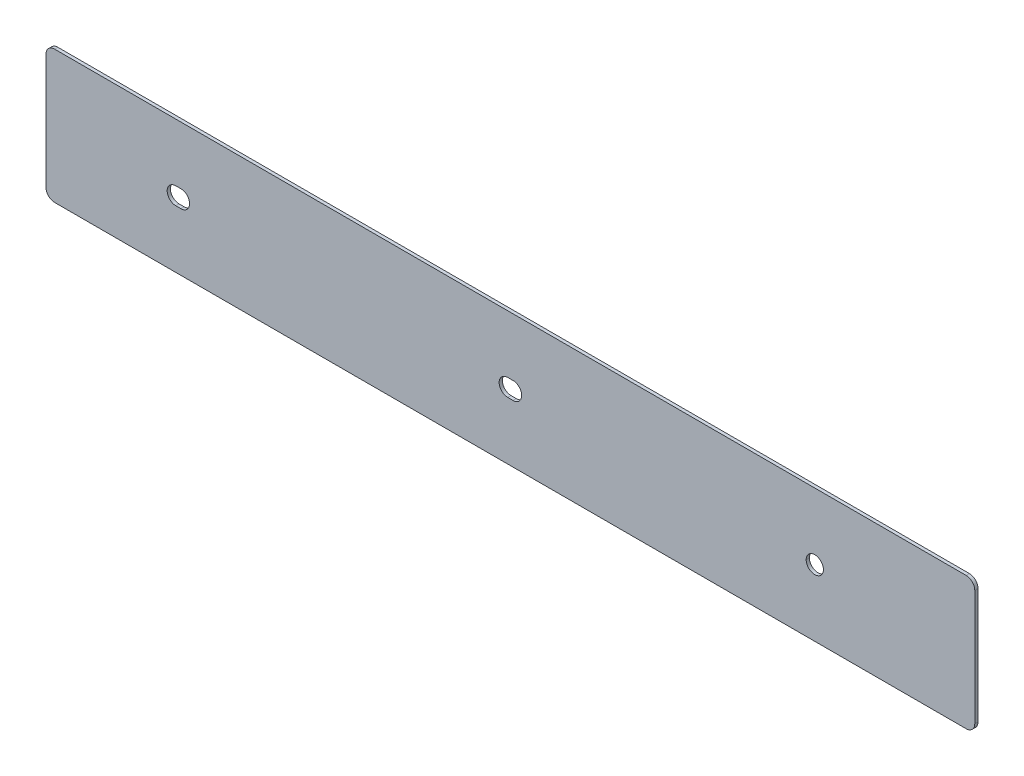
ISO-10303-21;
HEADER;
FILE_DESCRIPTION(('STEP AP214'),'2;1');
FILE_NAME('part.step','',(''),(''),'','','');
FILE_SCHEMA(('AUTOMOTIVE_DESIGN { 1 0 10303 214 1 1 1 1 }'));
ENDSEC;
DATA;
#1=APPLICATION_CONTEXT('core data for automotive mechanical design processes');
#2=APPLICATION_PROTOCOL_DEFINITION('international standard','automotive_design',2000,#1);
#3=PRODUCT_CONTEXT('',#1,'mechanical');
#4=PRODUCT('Part','Part','',(#3));
#5=PRODUCT_RELATED_PRODUCT_CATEGORY('part','',(#4));
#6=PRODUCT_DEFINITION_FORMATION('','',#4);
#7=PRODUCT_DEFINITION_CONTEXT('part definition',#1,'design');
#8=PRODUCT_DEFINITION('design','',#6,#7);
#9=PRODUCT_DEFINITION_SHAPE('','',#8);
#10=(LENGTH_UNIT() NAMED_UNIT(*) SI_UNIT(.MILLI.,.METRE.));
#11=(NAMED_UNIT(*) PLANE_ANGLE_UNIT() SI_UNIT($,.RADIAN.));
#12=(NAMED_UNIT(*) SI_UNIT($,.STERADIAN.) SOLID_ANGLE_UNIT());
#13=UNCERTAINTY_MEASURE_WITH_UNIT(LENGTH_MEASURE(1.E-05),#10,'distance_accuracy_value','');
#14=(GEOMETRIC_REPRESENTATION_CONTEXT(3) GLOBAL_UNCERTAINTY_ASSIGNED_CONTEXT((#13)) GLOBAL_UNIT_ASSIGNED_CONTEXT((#10,
#11,#12)) REPRESENTATION_CONTEXT('',''));
#15=CARTESIAN_POINT('',(0.,0.,0.));
#16=DIRECTION('',(0.,0.,1.));
#17=DIRECTION('',(1.,0.,0.));
#18=AXIS2_PLACEMENT_3D('',#15,#16,#17);
#19=CARTESIAN_POINT('',(-0.3,0.,-11.92));
#20=DIRECTION('',(0.,0.,1.));
#21=DIRECTION('',(1.,0.,0.));
#22=AXIS2_PLACEMENT_3D('',#19,#20,#21);
#23=CYLINDRICAL_SURFACE('',#22,1.);
#24=DIRECTION('',(0.,0.,1.));
#25=VECTOR('',#24,1.);
#26=CARTESIAN_POINT('',(-0.2999999999993,-1.,-12.295));
#27=LINE('',#26,#25);
#28=CARTESIAN_POINT('',(-0.2999999999993,-1.,-12.295));
#29=VERTEX_POINT('',#28);
#30=CARTESIAN_POINT('',(-0.2999999999978,-1.,-11.92));
#31=VERTEX_POINT('',#30);
#32=EDGE_CURVE('E11',#29,#31,#27,.T.);
#33=ORIENTED_EDGE('',*,*,#32,.F.);
#34=CARTESIAN_POINT('',(-0.3,0.,-12.295));
#35=DIRECTION('',(0.,0.,-1.));
#36=DIRECTION('',(2.190136960678E-12,-1.,0.));
#37=AXIS2_PLACEMENT_3D('',#34,#35,#36);
#38=CIRCLE('',#37,1.);
#39=CARTESIAN_POINT('',(-1.3,0.,-12.295));
#40=VERTEX_POINT('',#39);
#41=EDGE_CURVE('E337',#29,#40,#38,.T.);
#42=ORIENTED_EDGE('',*,*,#41,.T.);
#43=CARTESIAN_POINT('',(-0.3,0.,-12.295));
#44=DIRECTION('',(0.,0.,-1.));
#45=DIRECTION('',(-1.,0.,0.));
#46=AXIS2_PLACEMENT_3D('',#43,#44,#45);
#47=CIRCLE('',#46,1.);
#48=CARTESIAN_POINT('',(-0.3,1.,-12.295));
#49=VERTEX_POINT('',#48);
#50=EDGE_CURVE('E342',#40,#49,#47,.T.);
#51=ORIENTED_EDGE('',*,*,#50,.T.);
#52=DIRECTION('',(0.,0.,-1.));
#53=VECTOR('',#52,1.);
#54=CARTESIAN_POINT('',(-0.3,1.,-11.92));
#55=LINE('',#54,#53);
#56=CARTESIAN_POINT('',(-0.3,1.,-11.92));
#57=VERTEX_POINT('',#56);
#58=EDGE_CURVE('E372',#57,#49,#55,.T.);
#59=ORIENTED_EDGE('',*,*,#58,.F.);
#60=CARTESIAN_POINT('',(-0.3,0.,-11.92));
#61=DIRECTION('',(0.,0.,1.));
#62=DIRECTION('',(0.,1.,0.));
#63=AXIS2_PLACEMENT_3D('',#60,#61,#62);
#64=CIRCLE('',#63,1.);
#65=CARTESIAN_POINT('',(-1.3,0.,-11.92));
#66=VERTEX_POINT('',#65);
#67=EDGE_CURVE('E245',#57,#66,#64,.T.);
#68=ORIENTED_EDGE('',*,*,#67,.T.);
#69=CARTESIAN_POINT('',(-0.3,0.,-11.92));
#70=DIRECTION('',(0.,0.,1.));
#71=DIRECTION('',(-1.,0.,0.));
#72=AXIS2_PLACEMENT_3D('',#69,#70,#71);
#73=CIRCLE('',#72,1.);
#74=EDGE_CURVE('E243',#66,#31,#73,.T.);
#75=ORIENTED_EDGE('',*,*,#74,.T.);
#76=EDGE_LOOP('',(#33,#42,#51,#59,#68,#75));
#77=FACE_BOUND('',#76,.T.);
#78=ADVANCED_FACE('F17',(#77),#23,.F.);
#79=CARTESIAN_POINT('',(0.3,-1.007966227043,-11.92));
#80=DIRECTION('',(0.0132758749875694,0.999911871688358,0.));
#81=DIRECTION('',(0.,0.,-1.));
#82=AXIS2_PLACEMENT_3D('',#79,#80,#81);
#83=PLANE('',#82);
#84=DIRECTION('',(0.,0.,-1.));
#85=VECTOR('',#84,1.);
#86=CARTESIAN_POINT('',(0.3,-1.007966227043,-11.92));
#87=LINE('',#86,#85);
#88=CARTESIAN_POINT('',(0.3,-1.007966227043,-11.92));
#89=VERTEX_POINT('',#88);
#90=CARTESIAN_POINT('',(0.3,-1.007966227043,-12.295));
#91=VERTEX_POINT('',#90);
#92=EDGE_CURVE('E28',#89,#91,#87,.T.);
#93=ORIENTED_EDGE('',*,*,#92,.T.);
#94=DIRECTION('',(0.999911871688355,-0.0132758749877494,0.));
#95=VECTOR('',#94,1.);
#96=CARTESIAN_POINT('',(-0.2999999999993,-1.,-12.295));
#97=LINE('',#96,#95);
#98=EDGE_CURVE('E341',#29,#91,#97,.T.);
#99=ORIENTED_EDGE('',*,*,#98,.F.);
#100=ORIENTED_EDGE('',*,*,#32,.T.);
#101=DIRECTION('',(0.999911871688355,-0.0132758749877494,0.));
#102=VECTOR('',#101,1.);
#103=CARTESIAN_POINT('',(-0.2999999999993,-1.,-11.92));
#104=LINE('',#103,#102);
#105=EDGE_CURVE('E246',#31,#89,#104,.T.);
#106=ORIENTED_EDGE('',*,*,#105,.T.);
#107=EDGE_LOOP('',(#93,#99,#100,#106));
#108=FACE_BOUND('',#107,.T.);
#109=ADVANCED_FACE('F533',(#108),#83,.T.);
#110=CARTESIAN_POINT('',(0.3,0.,-11.92));
#111=DIRECTION('',(0.,0.,1.));
#112=DIRECTION('',(1.,0.,0.));
#113=AXIS2_PLACEMENT_3D('',#110,#111,#112);
#114=CYLINDRICAL_SURFACE('',#113,1.007966227043);
#115=DIRECTION('',(0.,0.,1.));
#116=VECTOR('',#115,1.);
#117=CARTESIAN_POINT('',(0.4264749574373,1.,-12.295));
#118=LINE('',#117,#116);
#119=CARTESIAN_POINT('',(0.4264749574373,1.,-12.295));
#120=VERTEX_POINT('',#119);
#121=CARTESIAN_POINT('',(0.4264749574373,1.,-11.92));
#122=VERTEX_POINT('',#121);
#123=EDGE_CURVE('E42',#120,#122,#118,.T.);
#124=ORIENTED_EDGE('',*,*,#123,.F.);
#125=CARTESIAN_POINT('',(0.3,0.,-12.295));
#126=DIRECTION('',(0.,0.,-1.));
#127=DIRECTION('',(0.125475391977297,0.992096732182978,0.));
#128=AXIS2_PLACEMENT_3D('',#125,#126,#127);
#129=CIRCLE('',#128,1.007966227043);
#130=CARTESIAN_POINT('',(1.307966227043,0.,-12.295));
#131=VERTEX_POINT('',#130);
#132=EDGE_CURVE('E309',#120,#131,#129,.T.);
#133=ORIENTED_EDGE('',*,*,#132,.T.);
#134=CARTESIAN_POINT('',(0.3,0.,-12.295));
#135=DIRECTION('',(0.,0.,-1.));
#136=DIRECTION('',(1.,0.,0.));
#137=AXIS2_PLACEMENT_3D('',#134,#135,#136);
#138=CIRCLE('',#137,1.007966227043);
#139=EDGE_CURVE('E367',#131,#91,#138,.T.);
#140=ORIENTED_EDGE('',*,*,#139,.T.);
#141=ORIENTED_EDGE('',*,*,#92,.F.);
#142=CARTESIAN_POINT('',(0.3,0.,-11.92));
#143=DIRECTION('',(0.,0.,1.));
#144=DIRECTION('',(0.,-1.,0.));
#145=AXIS2_PLACEMENT_3D('',#142,#143,#144);
#146=CIRCLE('',#145,1.007966227043);
#147=CARTESIAN_POINT('',(1.307966227043,0.,-11.92));
#148=VERTEX_POINT('',#147);
#149=EDGE_CURVE('E314',#89,#148,#146,.T.);
#150=ORIENTED_EDGE('',*,*,#149,.T.);
#151=CARTESIAN_POINT('',(0.3,0.,-11.92));
#152=DIRECTION('',(0.,0.,1.));
#153=DIRECTION('',(1.,0.,0.));
#154=AXIS2_PLACEMENT_3D('',#151,#152,#153);
#155=CIRCLE('',#154,1.007966227043);
#156=EDGE_CURVE('E316',#148,#122,#155,.T.);
#157=ORIENTED_EDGE('',*,*,#156,.T.);
#158=EDGE_LOOP('',(#124,#133,#140,#141,#150,#157));
#159=FACE_BOUND('',#158,.T.);
#160=ADVANCED_FACE('F528',(#159),#114,.F.);
#161=CARTESIAN_POINT('',(-0.3,1.,-11.92));
#162=DIRECTION('',(0.,-1.,0.));
#163=DIRECTION('',(0.,0.,-1.));
#164=AXIS2_PLACEMENT_3D('',#161,#162,#163);
#165=PLANE('',#164);
#166=ORIENTED_EDGE('',*,*,#58,.T.);
#167=DIRECTION('',(-1.,-1.433482581109E-13,0.));
#168=VECTOR('',#167,1.);
#169=CARTESIAN_POINT('',(0.4264749574373,1.,-12.295));
#170=LINE('',#169,#168);
#171=EDGE_CURVE('E299',#120,#49,#170,.T.);
#172=ORIENTED_EDGE('',*,*,#171,.F.);
#173=ORIENTED_EDGE('',*,*,#123,.T.);
#174=DIRECTION('',(-1.,-1.433482581109E-13,0.));
#175=VECTOR('',#174,1.);
#176=CARTESIAN_POINT('',(0.4264749574373,1.,-11.92));
#177=LINE('',#176,#175);
#178=EDGE_CURVE('E329',#122,#57,#177,.T.);
#179=ORIENTED_EDGE('',*,*,#178,.T.);
#180=EDGE_LOOP('',(#166,#172,#173,#179));
#181=FACE_BOUND('',#180,.T.);
#182=ADVANCED_FACE('F532',(#181),#165,.T.);
#183=CARTESIAN_POINT('',(-38.8,0.,-11.92));
#184=DIRECTION('',(0.,0.,1.));
#185=DIRECTION('',(1.,0.,0.));
#186=AXIS2_PLACEMENT_3D('',#183,#184,#185);
#187=CYLINDRICAL_SURFACE('',#186,1.);
#188=DIRECTION('',(0.,0.,1.));
#189=VECTOR('',#188,1.);
#190=CARTESIAN_POINT('',(-38.8,-1.,-12.295));
#191=LINE('',#190,#189);
#192=CARTESIAN_POINT('',(-38.8,-1.,-12.295));
#193=VERTEX_POINT('',#192);
#194=CARTESIAN_POINT('',(-38.8,-1.,-11.92));
#195=VERTEX_POINT('',#194);
#196=EDGE_CURVE('E369',#193,#195,#191,.T.);
#197=ORIENTED_EDGE('',*,*,#196,.F.);
#198=CARTESIAN_POINT('',(-38.8,0.,-12.295));
#199=DIRECTION('',(0.,0.,-1.));
#200=DIRECTION('',(0.,-1.,0.));
#201=AXIS2_PLACEMENT_3D('',#198,#199,#200);
#202=CIRCLE('',#201,1.);
#203=CARTESIAN_POINT('',(-39.8,0.,-12.295));
#204=VERTEX_POINT('',#203);
#205=EDGE_CURVE('E181',#193,#204,#202,.T.);
#206=ORIENTED_EDGE('',*,*,#205,.T.);
#207=CARTESIAN_POINT('',(-38.8,0.,-12.295));
#208=DIRECTION('',(0.,0.,-1.));
#209=DIRECTION('',(-1.,0.,0.));
#210=AXIS2_PLACEMENT_3D('',#207,#208,#209);
#211=CIRCLE('',#210,1.);
#212=CARTESIAN_POINT('',(-38.8,1.,-12.295));
#213=VERTEX_POINT('',#212);
#214=EDGE_CURVE('E277',#204,#213,#211,.T.);
#215=ORIENTED_EDGE('',*,*,#214,.T.);
#216=DIRECTION('',(0.,0.,-1.));
#217=VECTOR('',#216,1.);
#218=CARTESIAN_POINT('',(-38.8,1.,-11.92));
#219=LINE('',#218,#217);
#220=CARTESIAN_POINT('',(-38.8,1.,-11.92));
#221=VERTEX_POINT('',#220);
#222=EDGE_CURVE('E192',#221,#213,#219,.T.);
#223=ORIENTED_EDGE('',*,*,#222,.F.);
#224=CARTESIAN_POINT('',(-38.8,0.,-11.92));
#225=DIRECTION('',(0.,0.,1.));
#226=DIRECTION('',(0.,1.,0.));
#227=AXIS2_PLACEMENT_3D('',#224,#225,#226);
#228=CIRCLE('',#227,1.);
#229=CARTESIAN_POINT('',(-39.8,0.,-11.92));
#230=VERTEX_POINT('',#229);
#231=EDGE_CURVE('E215',#221,#230,#228,.T.);
#232=ORIENTED_EDGE('',*,*,#231,.T.);
#233=CARTESIAN_POINT('',(-38.8,0.,-11.92));
#234=DIRECTION('',(0.,0.,1.));
#235=DIRECTION('',(-1.,0.,0.));
#236=AXIS2_PLACEMENT_3D('',#233,#234,#235);
#237=CIRCLE('',#236,1.);
#238=EDGE_CURVE('E218',#230,#195,#237,.T.);
#239=ORIENTED_EDGE('',*,*,#238,.T.);
#240=EDGE_LOOP('',(#197,#206,#215,#223,#232,#239));
#241=FACE_BOUND('',#240,.T.);
#242=ADVANCED_FACE('F217',(#241),#187,.F.);
#243=CARTESIAN_POINT('',(-38.2,-1.,-11.92));
#244=DIRECTION('',(0.,1.,0.));
#245=DIRECTION('',(1.,0.,0.));
#246=AXIS2_PLACEMENT_3D('',#243,#244,#245);
#247=PLANE('',#246);
#248=DIRECTION('',(0.,0.,-1.));
#249=VECTOR('',#248,1.);
#250=CARTESIAN_POINT('',(-38.2,-1.,-11.92));
#251=LINE('',#250,#249);
#252=CARTESIAN_POINT('',(-38.2,-1.,-11.92));
#253=VERTEX_POINT('',#252);
#254=CARTESIAN_POINT('',(-38.2,-1.,-12.295));
#255=VERTEX_POINT('',#254);
#256=EDGE_CURVE('E373',#253,#255,#251,.T.);
#257=ORIENTED_EDGE('',*,*,#256,.T.);
#258=DIRECTION('',(1.,0.,0.));
#259=VECTOR('',#258,1.);
#260=CARTESIAN_POINT('',(-38.8,-1.,-12.295));
#261=LINE('',#260,#259);
#262=EDGE_CURVE('E354',#193,#255,#261,.T.);
#263=ORIENTED_EDGE('',*,*,#262,.F.);
#264=ORIENTED_EDGE('',*,*,#196,.T.);
#265=DIRECTION('',(1.,0.,0.));
#266=VECTOR('',#265,1.);
#267=CARTESIAN_POINT('',(-38.8,-1.,-11.92));
#268=LINE('',#267,#266);
#269=EDGE_CURVE('E230',#195,#253,#268,.T.);
#270=ORIENTED_EDGE('',*,*,#269,.T.);
#271=EDGE_LOOP('',(#257,#263,#264,#270));
#272=FACE_BOUND('',#271,.T.);
#273=ADVANCED_FACE('F541',(#272),#247,.T.);
#274=CARTESIAN_POINT('',(-38.2,0.,-11.92));
#275=DIRECTION('',(0.,0.,1.));
#276=DIRECTION('',(1.,0.,0.));
#277=AXIS2_PLACEMENT_3D('',#274,#275,#276);
#278=CYLINDRICAL_SURFACE('',#277,1.);
#279=DIRECTION('',(0.,0.,1.));
#280=VECTOR('',#279,1.);
#281=CARTESIAN_POINT('',(-38.2,1.,-12.295));
#282=LINE('',#281,#280);
#283=CARTESIAN_POINT('',(-38.2,1.,-12.295));
#284=VERTEX_POINT('',#283);
#285=CARTESIAN_POINT('',(-38.2,1.,-11.92));
#286=VERTEX_POINT('',#285);
#287=EDGE_CURVE('E296',#284,#286,#282,.T.);
#288=ORIENTED_EDGE('',*,*,#287,.F.);
#289=CARTESIAN_POINT('',(-38.2,0.,-12.295));
#290=DIRECTION('',(0.,0.,-1.));
#291=DIRECTION('',(0.,1.,0.));
#292=AXIS2_PLACEMENT_3D('',#289,#290,#291);
#293=CIRCLE('',#292,1.);
#294=CARTESIAN_POINT('',(-37.2,0.,-12.295));
#295=VERTEX_POINT('',#294);
#296=EDGE_CURVE('E279',#284,#295,#293,.T.);
#297=ORIENTED_EDGE('',*,*,#296,.T.);
#298=CARTESIAN_POINT('',(-38.2,0.,-12.295));
#299=DIRECTION('',(0.,0.,-1.));
#300=DIRECTION('',(1.,0.,0.));
#301=AXIS2_PLACEMENT_3D('',#298,#299,#300);
#302=CIRCLE('',#301,1.);
#303=EDGE_CURVE('E283',#295,#255,#302,.T.);
#304=ORIENTED_EDGE('',*,*,#303,.T.);
#305=ORIENTED_EDGE('',*,*,#256,.F.);
#306=CARTESIAN_POINT('',(-38.2,0.,-11.92));
#307=DIRECTION('',(0.,0.,1.));
#308=DIRECTION('',(0.,-1.,0.));
#309=AXIS2_PLACEMENT_3D('',#306,#307,#308);
#310=CIRCLE('',#309,1.);
#311=CARTESIAN_POINT('',(-37.2,0.,-11.92));
#312=VERTEX_POINT('',#311);
#313=EDGE_CURVE('E237',#253,#312,#310,.T.);
#314=ORIENTED_EDGE('',*,*,#313,.T.);
#315=CARTESIAN_POINT('',(-38.2,0.,-11.92));
#316=DIRECTION('',(0.,0.,1.));
#317=DIRECTION('',(1.,0.,0.));
#318=AXIS2_PLACEMENT_3D('',#315,#316,#317);
#319=CIRCLE('',#318,1.);
#320=EDGE_CURVE('E355',#312,#286,#319,.T.);
#321=ORIENTED_EDGE('',*,*,#320,.T.);
#322=EDGE_LOOP('',(#288,#297,#304,#305,#314,#321));
#323=FACE_BOUND('',#322,.T.);
#324=ADVANCED_FACE('F516',(#323),#278,.F.);
#325=CARTESIAN_POINT('',(-38.8,1.,-11.92));
#326=DIRECTION('',(0.,-1.,0.));
#327=DIRECTION('',(0.,0.,-1.));
#328=AXIS2_PLACEMENT_3D('',#325,#326,#327);
#329=PLANE('',#328);
#330=ORIENTED_EDGE('',*,*,#222,.T.);
#331=DIRECTION('',(-1.,0.,0.));
#332=VECTOR('',#331,1.);
#333=CARTESIAN_POINT('',(-38.2,1.,-12.295));
#334=LINE('',#333,#332);
#335=EDGE_CURVE('E282',#284,#213,#334,.T.);
#336=ORIENTED_EDGE('',*,*,#335,.F.);
#337=ORIENTED_EDGE('',*,*,#287,.T.);
#338=DIRECTION('',(-1.,0.,0.));
#339=VECTOR('',#338,1.);
#340=CARTESIAN_POINT('',(-38.2,1.,-11.92));
#341=LINE('',#340,#339);
#342=EDGE_CURVE('E223',#286,#221,#341,.T.);
#343=ORIENTED_EDGE('',*,*,#342,.T.);
#344=EDGE_LOOP('',(#330,#336,#337,#343));
#345=FACE_BOUND('',#344,.T.);
#346=ADVANCED_FACE('F512',(#345),#329,.T.);
#347=CARTESIAN_POINT('',(35.3,0.,-11.92));
#348=DIRECTION('',(0.,0.,1.));
#349=DIRECTION('',(1.,0.,0.));
#350=AXIS2_PLACEMENT_3D('',#347,#348,#349);
#351=CYLINDRICAL_SURFACE('',#350,1.);
#352=DIRECTION('',(0.,0.,1.));
#353=VECTOR('',#352,1.);
#354=CARTESIAN_POINT('',(34.3,0.,-12.295));
#355=LINE('',#354,#353);
#356=CARTESIAN_POINT('',(34.3,0.,-12.295));
#357=VERTEX_POINT('',#356);
#358=CARTESIAN_POINT('',(34.3,0.,-11.92));
#359=VERTEX_POINT('',#358);
#360=EDGE_CURVE('E288',#357,#359,#355,.T.);
#361=ORIENTED_EDGE('',*,*,#360,.F.);
#362=CARTESIAN_POINT('',(35.3,0.,-12.295));
#363=DIRECTION('',(0.,0.,-1.));
#364=DIRECTION('',(-1.,0.,0.));
#365=AXIS2_PLACEMENT_3D('',#362,#363,#364);
#366=CIRCLE('',#365,1.);
#367=CARTESIAN_POINT('',(36.3,0.,-12.295));
#368=VERTEX_POINT('',#367);
#369=EDGE_CURVE('E287',#357,#368,#366,.T.);
#370=ORIENTED_EDGE('',*,*,#369,.T.);
#371=DIRECTION('',(0.,0.,1.));
#372=VECTOR('',#371,1.);
#373=CARTESIAN_POINT('',(36.3,0.,-12.295));
#374=LINE('',#373,#372);
#375=CARTESIAN_POINT('',(36.3,0.,-11.92));
#376=VERTEX_POINT('',#375);
#377=EDGE_CURVE('E290',#368,#376,#374,.T.);
#378=ORIENTED_EDGE('',*,*,#377,.T.);
#379=CARTESIAN_POINT('',(35.3,0.,-11.92));
#380=DIRECTION('',(0.,0.,1.));
#381=DIRECTION('',(1.,0.,0.));
#382=AXIS2_PLACEMENT_3D('',#379,#380,#381);
#383=CIRCLE('',#382,1.);
#384=EDGE_CURVE('E407',#376,#359,#383,.T.);
#385=ORIENTED_EDGE('',*,*,#384,.T.);
#386=EDGE_LOOP('',(#361,#370,#378,#385));
#387=FACE_BOUND('',#386,.T.);
#388=ADVANCED_FACE('F452',(#387),#351,.F.);
#389=CARTESIAN_POINT('',(35.3,0.,-11.92));
#390=DIRECTION('',(0.,0.,1.));
#391=DIRECTION('',(1.,0.,0.));
#392=AXIS2_PLACEMENT_3D('',#389,#390,#391);
#393=CYLINDRICAL_SURFACE('',#392,1.);
#394=ORIENTED_EDGE('',*,*,#377,.F.);
#395=CARTESIAN_POINT('',(35.3,0.,-12.295));
#396=DIRECTION('',(0.,0.,-1.));
#397=DIRECTION('',(1.,0.,0.));
#398=AXIS2_PLACEMENT_3D('',#395,#396,#397);
#399=CIRCLE('',#398,1.);
#400=EDGE_CURVE('E284',#368,#357,#399,.T.);
#401=ORIENTED_EDGE('',*,*,#400,.T.);
#402=ORIENTED_EDGE('',*,*,#360,.T.);
#403=CARTESIAN_POINT('',(35.3,0.,-11.92));
#404=DIRECTION('',(0.,0.,1.));
#405=DIRECTION('',(-1.,0.,0.));
#406=AXIS2_PLACEMENT_3D('',#403,#404,#405);
#407=CIRCLE('',#406,1.);
#408=EDGE_CURVE('E359',#359,#376,#407,.T.);
#409=ORIENTED_EDGE('',*,*,#408,.T.);
#410=EDGE_LOOP('',(#394,#401,#402,#409));
#411=FACE_BOUND('',#410,.T.);
#412=ADVANCED_FACE('F456',(#411),#393,.F.);
#413=CARTESIAN_POINT('',(0.,0.,-12.295));
#414=DIRECTION('',(0.,0.,1.));
#415=DIRECTION('',(1.,0.,0.));
#416=AXIS2_PLACEMENT_3D('',#413,#414,#415);
#417=PLANE('',#416);
#418=ORIENTED_EDGE('',*,*,#50,.F.);
#419=ORIENTED_EDGE('',*,*,#41,.F.);
#420=ORIENTED_EDGE('',*,*,#98,.T.);
#421=ORIENTED_EDGE('',*,*,#139,.F.);
#422=ORIENTED_EDGE('',*,*,#132,.F.);
#423=ORIENTED_EDGE('',*,*,#171,.T.);
#424=EDGE_LOOP('',(#418,#419,#420,#421,#422,#423));
#425=FACE_BOUND('',#424,.T.);
#426=ORIENTED_EDGE('',*,*,#214,.F.);
#427=ORIENTED_EDGE('',*,*,#205,.F.);
#428=ORIENTED_EDGE('',*,*,#262,.T.);
#429=ORIENTED_EDGE('',*,*,#303,.F.);
#430=ORIENTED_EDGE('',*,*,#296,.F.);
#431=ORIENTED_EDGE('',*,*,#335,.T.);
#432=EDGE_LOOP('',(#426,#427,#428,#429,#430,#431));
#433=FACE_BOUND('',#432,.T.);
#434=ORIENTED_EDGE('',*,*,#369,.F.);
#435=ORIENTED_EDGE('',*,*,#400,.F.);
#436=EDGE_LOOP('',(#434,#435));
#437=FACE_BOUND('',#436,.T.);
#438=DIRECTION('',(0.,-1.,0.));
#439=VECTOR('',#438,1.);
#440=CARTESIAN_POINT('',(53.85,6.7,-12.295));
#441=LINE('',#440,#439);
#442=CARTESIAN_POINT('',(53.85,6.7,-12.295));
#443=VERTEX_POINT('',#442);
#444=CARTESIAN_POINT('',(53.85,-6.7,-12.295));
#445=VERTEX_POINT('',#444);
#446=EDGE_CURVE('E343',#443,#445,#441,.T.);
#447=ORIENTED_EDGE('',*,*,#446,.T.);
#448=CARTESIAN_POINT('',(52.85,-6.7,-12.295));
#449=DIRECTION('',(0.,0.,1.));
#450=DIRECTION('',(0.,-1.,0.));
#451=AXIS2_PLACEMENT_3D('',#448,#449,#450);
#452=CIRCLE('',#451,1.);
#453=CARTESIAN_POINT('',(52.85,-7.7,-12.295));
#454=VERTEX_POINT('',#453);
#455=EDGE_CURVE('E241',#454,#445,#452,.T.);
#456=ORIENTED_EDGE('',*,*,#455,.F.);
#457=DIRECTION('',(-1.,0.,0.));
#458=VECTOR('',#457,1.);
#459=CARTESIAN_POINT('',(52.85,-7.7,-12.295));
#460=LINE('',#459,#458);
#461=CARTESIAN_POINT('',(-52.85,-7.7,-12.295));
#462=VERTEX_POINT('',#461);
#463=EDGE_CURVE('E319',#454,#462,#460,.T.);
#464=ORIENTED_EDGE('',*,*,#463,.T.);
#465=CARTESIAN_POINT('',(-52.85,-6.7,-12.295));
#466=DIRECTION('',(0.,0.,1.));
#467=DIRECTION('',(-1.,0.,0.));
#468=AXIS2_PLACEMENT_3D('',#465,#466,#467);
#469=CIRCLE('',#468,1.);
#470=CARTESIAN_POINT('',(-53.85,-6.7,-12.295));
#471=VERTEX_POINT('',#470);
#472=EDGE_CURVE('E350',#471,#462,#469,.T.);
#473=ORIENTED_EDGE('',*,*,#472,.F.);
#474=DIRECTION('',(0.,1.,0.));
#475=VECTOR('',#474,1.);
#476=CARTESIAN_POINT('',(-53.85,-6.7,-12.295));
#477=LINE('',#476,#475);
#478=CARTESIAN_POINT('',(-53.85,6.7,-12.295));
#479=VERTEX_POINT('',#478);
#480=EDGE_CURVE('E382',#471,#479,#477,.T.);
#481=ORIENTED_EDGE('',*,*,#480,.T.);
#482=CARTESIAN_POINT('',(-52.85,6.7,-12.295));
#483=DIRECTION('',(0.,0.,1.));
#484=DIRECTION('',(0.,1.,0.));
#485=AXIS2_PLACEMENT_3D('',#482,#483,#484);
#486=CIRCLE('',#485,1.);
#487=CARTESIAN_POINT('',(-52.85,7.7,-12.295));
#488=VERTEX_POINT('',#487);
#489=EDGE_CURVE('E249',#488,#479,#486,.T.);
#490=ORIENTED_EDGE('',*,*,#489,.F.);
#491=DIRECTION('',(1.,0.,0.));
#492=VECTOR('',#491,1.);
#493=CARTESIAN_POINT('',(-52.85,7.7,-12.295));
#494=LINE('',#493,#492);
#495=CARTESIAN_POINT('',(52.85,7.7,-12.295));
#496=VERTEX_POINT('',#495);
#497=EDGE_CURVE('E250',#488,#496,#494,.T.);
#498=ORIENTED_EDGE('',*,*,#497,.T.);
#499=CARTESIAN_POINT('',(52.85,6.7,-12.295));
#500=DIRECTION('',(0.,0.,1.));
#501=DIRECTION('',(1.,0.,0.));
#502=AXIS2_PLACEMENT_3D('',#499,#500,#501);
#503=CIRCLE('',#502,1.);
#504=EDGE_CURVE('E273',#443,#496,#503,.T.);
#505=ORIENTED_EDGE('',*,*,#504,.F.);
#506=EDGE_LOOP('',(#447,#456,#464,#473,#481,#490,#498,#505));
#507=FACE_BOUND('',#506,.T.);
#508=ADVANCED_FACE('F455',(#425,#433,#437,#507),#417,.F.);
#509=CARTESIAN_POINT('',(53.85,-6.7,-11.92));
#510=DIRECTION('',(1.,0.,0.));
#511=DIRECTION('',(0.,1.,0.));
#512=AXIS2_PLACEMENT_3D('',#509,#510,#511);
#513=PLANE('',#512);
#514=DIRECTION('',(0.,0.,-1.));
#515=VECTOR('',#514,1.);
#516=CARTESIAN_POINT('',(53.85,-6.7,-11.92));
#517=LINE('',#516,#515);
#518=CARTESIAN_POINT('',(53.85,-6.7,-11.92));
#519=VERTEX_POINT('',#518);
#520=EDGE_CURVE('E346',#519,#445,#517,.T.);
#521=ORIENTED_EDGE('',*,*,#520,.T.);
#522=ORIENTED_EDGE('',*,*,#446,.F.);
#523=DIRECTION('',(0.,0.,1.));
#524=VECTOR('',#523,1.);
#525=CARTESIAN_POINT('',(53.85,6.7,-12.295));
#526=LINE('',#525,#524);
#527=CARTESIAN_POINT('',(53.85,6.7,-11.92));
#528=VERTEX_POINT('',#527);
#529=EDGE_CURVE('E327',#443,#528,#526,.T.);
#530=ORIENTED_EDGE('',*,*,#529,.T.);
#531=DIRECTION('',(0.,-1.,0.));
#532=VECTOR('',#531,1.);
#533=CARTESIAN_POINT('',(53.85,6.7,-11.92));
#534=LINE('',#533,#532);
#535=EDGE_CURVE('E21',#528,#519,#534,.T.);
#536=ORIENTED_EDGE('',*,*,#535,.T.);
#537=EDGE_LOOP('',(#521,#522,#530,#536));
#538=FACE_BOUND('',#537,.T.);
#539=ADVANCED_FACE('F475',(#538),#513,.T.);
#540=CARTESIAN_POINT('',(52.85,-6.7,-11.92));
#541=DIRECTION('',(0.,0.,1.));
#542=DIRECTION('',(1.,0.,0.));
#543=AXIS2_PLACEMENT_3D('',#540,#541,#542);
#544=CYLINDRICAL_SURFACE('',#543,1.);
#545=DIRECTION('',(0.,0.,1.));
#546=VECTOR('',#545,1.);
#547=CARTESIAN_POINT('',(52.85,-7.7,-12.295));
#548=LINE('',#547,#546);
#549=CARTESIAN_POINT('',(52.85,-7.7,-11.92));
#550=VERTEX_POINT('',#549);
#551=EDGE_CURVE('E322',#454,#550,#548,.T.);
#552=ORIENTED_EDGE('',*,*,#551,.F.);
#553=ORIENTED_EDGE('',*,*,#455,.T.);
#554=ORIENTED_EDGE('',*,*,#520,.F.);
#555=CARTESIAN_POINT('',(52.85,-6.7,-11.92));
#556=DIRECTION('',(0.,0.,-1.));
#557=DIRECTION('',(1.,0.,0.));
#558=AXIS2_PLACEMENT_3D('',#555,#556,#557);
#559=CIRCLE('',#558,1.);
#560=EDGE_CURVE('E377',#519,#550,#559,.T.);
#561=ORIENTED_EDGE('',*,*,#560,.T.);
#562=EDGE_LOOP('',(#552,#553,#554,#561));
#563=FACE_BOUND('',#562,.T.);
#564=ADVANCED_FACE('F478',(#563),#544,.T.);
#565=CARTESIAN_POINT('',(-52.85,-7.7,-11.92));
#566=DIRECTION('',(0.,-1.,0.));
#567=DIRECTION('',(0.,0.,-1.));
#568=AXIS2_PLACEMENT_3D('',#565,#566,#567);
#569=PLANE('',#568);
#570=DIRECTION('',(0.,0.,-1.));
#571=VECTOR('',#570,1.);
#572=CARTESIAN_POINT('',(-52.85,-7.7,-11.92));
#573=LINE('',#572,#571);
#574=CARTESIAN_POINT('',(-52.85,-7.7,-11.92));
#575=VERTEX_POINT('',#574);
#576=EDGE_CURVE('E323',#575,#462,#573,.T.);
#577=ORIENTED_EDGE('',*,*,#576,.T.);
#578=ORIENTED_EDGE('',*,*,#463,.F.);
#579=ORIENTED_EDGE('',*,*,#551,.T.);
#580=DIRECTION('',(-1.,0.,0.));
#581=VECTOR('',#580,1.);
#582=CARTESIAN_POINT('',(52.85,-7.7,-11.92));
#583=LINE('',#582,#581);
#584=EDGE_CURVE('E335',#550,#575,#583,.T.);
#585=ORIENTED_EDGE('',*,*,#584,.T.);
#586=EDGE_LOOP('',(#577,#578,#579,#585));
#587=FACE_BOUND('',#586,.T.);
#588=ADVANCED_FACE('F485',(#587),#569,.T.);
#589=CARTESIAN_POINT('',(-52.85,-6.7,-11.92));
#590=DIRECTION('',(0.,0.,1.));
#591=DIRECTION('',(1.,0.,0.));
#592=AXIS2_PLACEMENT_3D('',#589,#590,#591);
#593=CYLINDRICAL_SURFACE('',#592,1.);
#594=DIRECTION('',(0.,0.,1.));
#595=VECTOR('',#594,1.);
#596=CARTESIAN_POINT('',(-53.85,-6.7,-12.295));
#597=LINE('',#596,#595);
#598=CARTESIAN_POINT('',(-53.85,-6.7,-11.92));
#599=VERTEX_POINT('',#598);
#600=EDGE_CURVE('E380',#471,#599,#597,.T.);
#601=ORIENTED_EDGE('',*,*,#600,.F.);
#602=ORIENTED_EDGE('',*,*,#472,.T.);
#603=ORIENTED_EDGE('',*,*,#576,.F.);
#604=CARTESIAN_POINT('',(-52.85,-6.7,-11.92));
#605=DIRECTION('',(0.,0.,-1.));
#606=DIRECTION('',(0.,-1.,0.));
#607=AXIS2_PLACEMENT_3D('',#604,#605,#606);
#608=CIRCLE('',#607,1.);
#609=EDGE_CURVE('E331',#575,#599,#608,.T.);
#610=ORIENTED_EDGE('',*,*,#609,.T.);
#611=EDGE_LOOP('',(#601,#602,#603,#610));
#612=FACE_BOUND('',#611,.T.);
#613=ADVANCED_FACE('F490',(#612),#593,.T.);
#614=CARTESIAN_POINT('',(-53.85,6.7,-11.92));
#615=DIRECTION('',(-1.,0.,0.));
#616=DIRECTION('',(0.,0.,1.));
#617=AXIS2_PLACEMENT_3D('',#614,#615,#616);
#618=PLANE('',#617);
#619=DIRECTION('',(0.,0.,-1.));
#620=VECTOR('',#619,1.);
#621=CARTESIAN_POINT('',(-53.85,6.7,-11.92));
#622=LINE('',#621,#620);
#623=CARTESIAN_POINT('',(-53.85,6.7,-11.92));
#624=VERTEX_POINT('',#623);
#625=EDGE_CURVE('E260',#624,#479,#622,.T.);
#626=ORIENTED_EDGE('',*,*,#625,.T.);
#627=ORIENTED_EDGE('',*,*,#480,.F.);
#628=ORIENTED_EDGE('',*,*,#600,.T.);
#629=DIRECTION('',(0.,1.,0.));
#630=VECTOR('',#629,1.);
#631=CARTESIAN_POINT('',(-53.85,-6.7,-11.92));
#632=LINE('',#631,#630);
#633=EDGE_CURVE('E336',#599,#624,#632,.T.);
#634=ORIENTED_EDGE('',*,*,#633,.T.);
#635=EDGE_LOOP('',(#626,#627,#628,#634));
#636=FACE_BOUND('',#635,.T.);
#637=ADVANCED_FACE('F19',(#636),#618,.T.);
#638=CARTESIAN_POINT('',(-52.85,6.7,-11.92));
#639=DIRECTION('',(0.,0.,1.));
#640=DIRECTION('',(1.,0.,0.));
#641=AXIS2_PLACEMENT_3D('',#638,#639,#640);
#642=CYLINDRICAL_SURFACE('',#641,1.);
#643=DIRECTION('',(0.,0.,1.));
#644=VECTOR('',#643,1.);
#645=CARTESIAN_POINT('',(-52.85,7.7,-12.295));
#646=LINE('',#645,#644);
#647=CARTESIAN_POINT('',(-52.85,7.7,-11.92));
#648=VERTEX_POINT('',#647);
#649=EDGE_CURVE('E247',#488,#648,#646,.T.);
#650=ORIENTED_EDGE('',*,*,#649,.F.);
#651=ORIENTED_EDGE('',*,*,#489,.T.);
#652=ORIENTED_EDGE('',*,*,#625,.F.);
#653=CARTESIAN_POINT('',(-52.85,6.7,-11.92));
#654=DIRECTION('',(0.,0.,-1.));
#655=DIRECTION('',(-1.,0.,0.));
#656=AXIS2_PLACEMENT_3D('',#653,#654,#655);
#657=CIRCLE('',#656,1.);
#658=EDGE_CURVE('E360',#624,#648,#657,.T.);
#659=ORIENTED_EDGE('',*,*,#658,.T.);
#660=EDGE_LOOP('',(#650,#651,#652,#659));
#661=FACE_BOUND('',#660,.T.);
#662=ADVANCED_FACE('F495',(#661),#642,.T.);
#663=CARTESIAN_POINT('',(52.85,7.7,-11.92));
#664=DIRECTION('',(0.,1.,0.));
#665=DIRECTION('',(1.,0.,0.));
#666=AXIS2_PLACEMENT_3D('',#663,#664,#665);
#667=PLANE('',#666);
#668=DIRECTION('',(0.,0.,-1.));
#669=VECTOR('',#668,1.);
#670=CARTESIAN_POINT('',(52.85,7.7,-11.92));
#671=LINE('',#670,#669);
#672=CARTESIAN_POINT('',(52.85,7.7,-11.92));
#673=VERTEX_POINT('',#672);
#674=EDGE_CURVE('E263',#673,#496,#671,.T.);
#675=ORIENTED_EDGE('',*,*,#674,.T.);
#676=ORIENTED_EDGE('',*,*,#497,.F.);
#677=ORIENTED_EDGE('',*,*,#649,.T.);
#678=DIRECTION('',(1.,0.,0.));
#679=VECTOR('',#678,1.);
#680=CARTESIAN_POINT('',(-52.85,7.7,-11.92));
#681=LINE('',#680,#679);
#682=EDGE_CURVE('E363',#648,#673,#681,.T.);
#683=ORIENTED_EDGE('',*,*,#682,.T.);
#684=EDGE_LOOP('',(#675,#676,#677,#683));
#685=FACE_BOUND('',#684,.T.);
#686=ADVANCED_FACE('F468',(#685),#667,.T.);
#687=CARTESIAN_POINT('',(52.85,6.7,-11.92));
#688=DIRECTION('',(0.,0.,1.));
#689=DIRECTION('',(1.,0.,0.));
#690=AXIS2_PLACEMENT_3D('',#687,#688,#689);
#691=CYLINDRICAL_SURFACE('',#690,1.);
#692=ORIENTED_EDGE('',*,*,#529,.F.);
#693=ORIENTED_EDGE('',*,*,#504,.T.);
#694=ORIENTED_EDGE('',*,*,#674,.F.);
#695=CARTESIAN_POINT('',(52.85,6.7,-11.92));
#696=DIRECTION('',(0.,0.,-1.));
#697=DIRECTION('',(0.,1.,0.));
#698=AXIS2_PLACEMENT_3D('',#695,#696,#697);
#699=CIRCLE('',#698,1.);
#700=EDGE_CURVE('E423',#673,#528,#699,.T.);
#701=ORIENTED_EDGE('',*,*,#700,.T.);
#702=EDGE_LOOP('',(#692,#693,#694,#701));
#703=FACE_BOUND('',#702,.T.);
#704=ADVANCED_FACE('F460',(#703),#691,.T.);
#705=CARTESIAN_POINT('',(0.,0.,-11.92));
#706=DIRECTION('',(0.,0.,1.));
#707=DIRECTION('',(1.,0.,0.));
#708=AXIS2_PLACEMENT_3D('',#705,#706,#707);
#709=PLANE('',#708);
#710=ORIENTED_EDGE('',*,*,#156,.F.);
#711=ORIENTED_EDGE('',*,*,#149,.F.);
#712=ORIENTED_EDGE('',*,*,#105,.F.);
#713=ORIENTED_EDGE('',*,*,#74,.F.);
#714=ORIENTED_EDGE('',*,*,#67,.F.);
#715=ORIENTED_EDGE('',*,*,#178,.F.);
#716=EDGE_LOOP('',(#710,#711,#712,#713,#714,#715));
#717=FACE_BOUND('',#716,.T.);
#718=ORIENTED_EDGE('',*,*,#320,.F.);
#719=ORIENTED_EDGE('',*,*,#313,.F.);
#720=ORIENTED_EDGE('',*,*,#269,.F.);
#721=ORIENTED_EDGE('',*,*,#238,.F.);
#722=ORIENTED_EDGE('',*,*,#231,.F.);
#723=ORIENTED_EDGE('',*,*,#342,.F.);
#724=EDGE_LOOP('',(#718,#719,#720,#721,#722,#723));
#725=FACE_BOUND('',#724,.T.);
#726=ORIENTED_EDGE('',*,*,#384,.F.);
#727=ORIENTED_EDGE('',*,*,#408,.F.);
#728=EDGE_LOOP('',(#726,#727));
#729=FACE_BOUND('',#728,.T.);
#730=ORIENTED_EDGE('',*,*,#682,.F.);
#731=ORIENTED_EDGE('',*,*,#658,.F.);
#732=ORIENTED_EDGE('',*,*,#633,.F.);
#733=ORIENTED_EDGE('',*,*,#609,.F.);
#734=ORIENTED_EDGE('',*,*,#584,.F.);
#735=ORIENTED_EDGE('',*,*,#560,.F.);
#736=ORIENTED_EDGE('',*,*,#535,.F.);
#737=ORIENTED_EDGE('',*,*,#700,.F.);
#738=EDGE_LOOP('',(#730,#731,#732,#733,#734,#735,#736,#737));
#739=FACE_BOUND('',#738,.T.);
#740=ADVANCED_FACE('F226',(#717,#725,#729,#739),#709,.T.);
#741=CLOSED_SHELL('',(#78,#109,#160,#182,#242,#273,#324,#346,#388,#412,#508,#539,#564,#588,#613,
#637,#662,#686,#704,#740));
#742=MANIFOLD_SOLID_BREP('B1',#741);
#743=ADVANCED_BREP_SHAPE_REPRESENTATION('',(#18,#742),#14);
#744=SHAPE_DEFINITION_REPRESENTATION(#9,#743);
ENDSEC;
END-ISO-10303-21;
